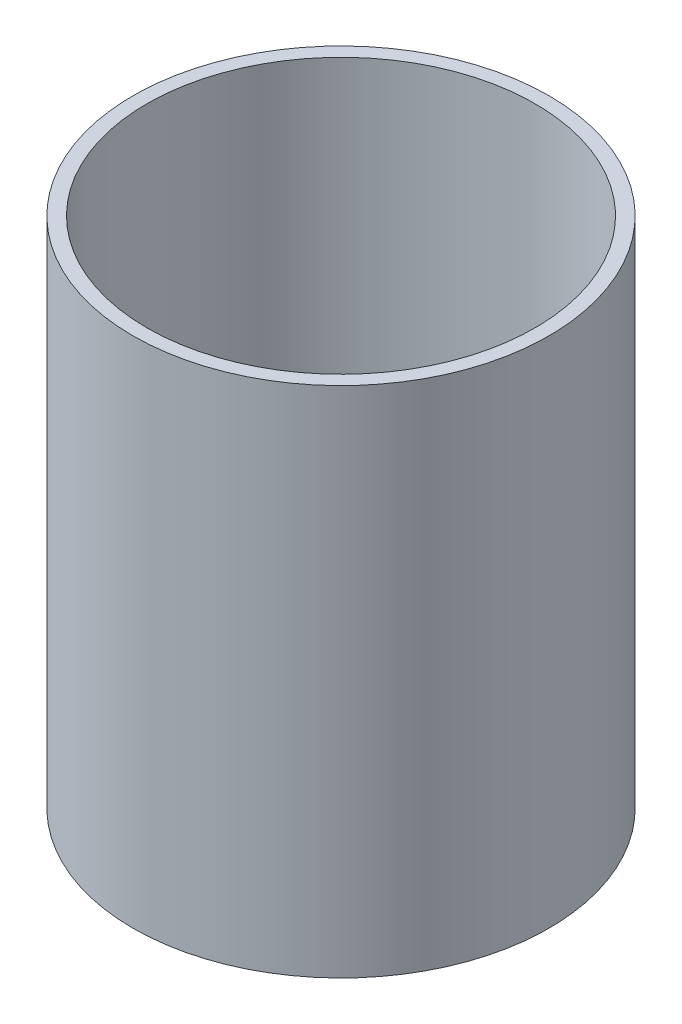
ISO-10303-21;
HEADER;
FILE_DESCRIPTION(('STEP AP214'),'2;1');
FILE_NAME('part.step','',(''),(''),'','','');
FILE_SCHEMA(('AUTOMOTIVE_DESIGN { 1 0 10303 214 1 1 1 1 }'));
ENDSEC;
DATA;
#1=APPLICATION_CONTEXT('core data for automotive mechanical design processes');
#2=APPLICATION_PROTOCOL_DEFINITION('international standard','automotive_design',2000,#1);
#3=PRODUCT_CONTEXT('',#1,'mechanical');
#4=PRODUCT('Part','Part','',(#3));
#5=PRODUCT_RELATED_PRODUCT_CATEGORY('part','',(#4));
#6=PRODUCT_DEFINITION_FORMATION('','',#4);
#7=PRODUCT_DEFINITION_CONTEXT('part definition',#1,'design');
#8=PRODUCT_DEFINITION('design','',#6,#7);
#9=PRODUCT_DEFINITION_SHAPE('','',#8);
#10=(LENGTH_UNIT() NAMED_UNIT(*) SI_UNIT(.MILLI.,.METRE.));
#11=(NAMED_UNIT(*) PLANE_ANGLE_UNIT() SI_UNIT($,.RADIAN.));
#12=(NAMED_UNIT(*) SI_UNIT($,.STERADIAN.) SOLID_ANGLE_UNIT());
#13=UNCERTAINTY_MEASURE_WITH_UNIT(LENGTH_MEASURE(1.E-05),#10,'distance_accuracy_value','');
#14=(GEOMETRIC_REPRESENTATION_CONTEXT(3) GLOBAL_UNCERTAINTY_ASSIGNED_CONTEXT((#13)) GLOBAL_UNIT_ASSIGNED_CONTEXT((#10,
#11,#12)) REPRESENTATION_CONTEXT('',''));
#15=CARTESIAN_POINT('',(0.,0.,0.));
#16=DIRECTION('',(0.,0.,1.));
#17=DIRECTION('',(1.,0.,0.));
#18=AXIS2_PLACEMENT_3D('',#15,#16,#17);
#19=CARTESIAN_POINT('',(0.,37.,0.));
#20=DIRECTION('',(0.,1.,0.));
#21=DIRECTION('',(0.,0.,1.));
#22=AXIS2_PLACEMENT_3D('',#19,#20,#21);
#23=PLANE('',#22);
#24=CARTESIAN_POINT('',(0.,37.,0.));
#25=DIRECTION('',(0.,1.,0.));
#26=DIRECTION('',(0.,0.,1.));
#27=AXIS2_PLACEMENT_3D('',#24,#25,#26);
#28=CIRCLE('',#27,15.);
#29=CARTESIAN_POINT('',(0.,37.,15.));
#30=VERTEX_POINT('',#29);
#31=EDGE_CURVE('E12',#30,#30,#28,.T.);
#32=ORIENTED_EDGE('',*,*,#31,.T.);
#33=EDGE_LOOP('',(#32));
#34=FACE_BOUND('',#33,.T.);
#35=CARTESIAN_POINT('',(0.,37.,0.));
#36=DIRECTION('',(0.,1.,0.));
#37=DIRECTION('',(0.,0.,1.));
#38=AXIS2_PLACEMENT_3D('',#35,#36,#37);
#39=CIRCLE('',#38,14.);
#40=CARTESIAN_POINT('',(0.,37.,14.));
#41=VERTEX_POINT('',#40);
#42=EDGE_CURVE('E53',#41,#41,#39,.T.);
#43=ORIENTED_EDGE('',*,*,#42,.F.);
#44=EDGE_LOOP('',(#43));
#45=FACE_BOUND('',#44,.T.);
#46=ADVANCED_FACE('F42',(#34,#45),#23,.T.);
#47=CARTESIAN_POINT('',(0.,0.,0.));
#48=DIRECTION('',(0.,1.,0.));
#49=DIRECTION('',(0.,0.,1.));
#50=AXIS2_PLACEMENT_3D('',#47,#48,#49);
#51=PLANE('',#50);
#52=CARTESIAN_POINT('',(0.,0.,0.));
#53=DIRECTION('',(0.,1.,0.));
#54=DIRECTION('',(0.,0.,1.));
#55=AXIS2_PLACEMENT_3D('',#52,#53,#54);
#56=CIRCLE('',#55,15.);
#57=CARTESIAN_POINT('',(0.,0.,15.));
#58=VERTEX_POINT('',#57);
#59=EDGE_CURVE('E46',#58,#58,#56,.T.);
#60=ORIENTED_EDGE('',*,*,#59,.F.);
#61=EDGE_LOOP('',(#60));
#62=FACE_BOUND('',#61,.T.);
#63=CARTESIAN_POINT('',(0.,0.,0.));
#64=DIRECTION('',(0.,1.,0.));
#65=DIRECTION('',(0.,0.,1.));
#66=AXIS2_PLACEMENT_3D('',#63,#64,#65);
#67=CIRCLE('',#66,14.);
#68=CARTESIAN_POINT('',(0.,0.,14.));
#69=VERTEX_POINT('',#68);
#70=EDGE_CURVE('E55',#69,#69,#67,.T.);
#71=ORIENTED_EDGE('',*,*,#70,.T.);
#72=EDGE_LOOP('',(#71));
#73=FACE_BOUND('',#72,.T.);
#74=ADVANCED_FACE('F65',(#62,#73),#51,.F.);
#75=CARTESIAN_POINT('',(0.,37.,0.));
#76=DIRECTION('',(0.,-1.,0.));
#77=DIRECTION('',(0.,0.,-1.));
#78=AXIS2_PLACEMENT_3D('',#75,#76,#77);
#79=CYLINDRICAL_SURFACE('',#78,15.);
#80=ORIENTED_EDGE('',*,*,#31,.F.);
#81=EDGE_LOOP('',(#80));
#82=FACE_BOUND('',#81,.T.);
#83=ORIENTED_EDGE('',*,*,#59,.T.);
#84=EDGE_LOOP('',(#83));
#85=FACE_BOUND('',#84,.T.);
#86=ADVANCED_FACE('F44',(#82,#85),#79,.T.);
#87=CARTESIAN_POINT('',(0.,37.,0.));
#88=DIRECTION('',(0.,-1.,0.));
#89=DIRECTION('',(0.,0.,-1.));
#90=AXIS2_PLACEMENT_3D('',#87,#88,#89);
#91=CYLINDRICAL_SURFACE('',#90,14.);
#92=ORIENTED_EDGE('',*,*,#42,.T.);
#93=EDGE_LOOP('',(#92));
#94=FACE_BOUND('',#93,.T.);
#95=ORIENTED_EDGE('',*,*,#70,.F.);
#96=EDGE_LOOP('',(#95));
#97=FACE_BOUND('',#96,.T.);
#98=ADVANCED_FACE('F61',(#94,#97),#91,.F.);
#99=CLOSED_SHELL('',(#46,#74,#86,#98));
#100=MANIFOLD_SOLID_BREP('B2',#99);
#101=ADVANCED_BREP_SHAPE_REPRESENTATION('',(#18,#100),#14);
#102=SHAPE_DEFINITION_REPRESENTATION(#9,#101);
ENDSEC;
END-ISO-10303-21;
